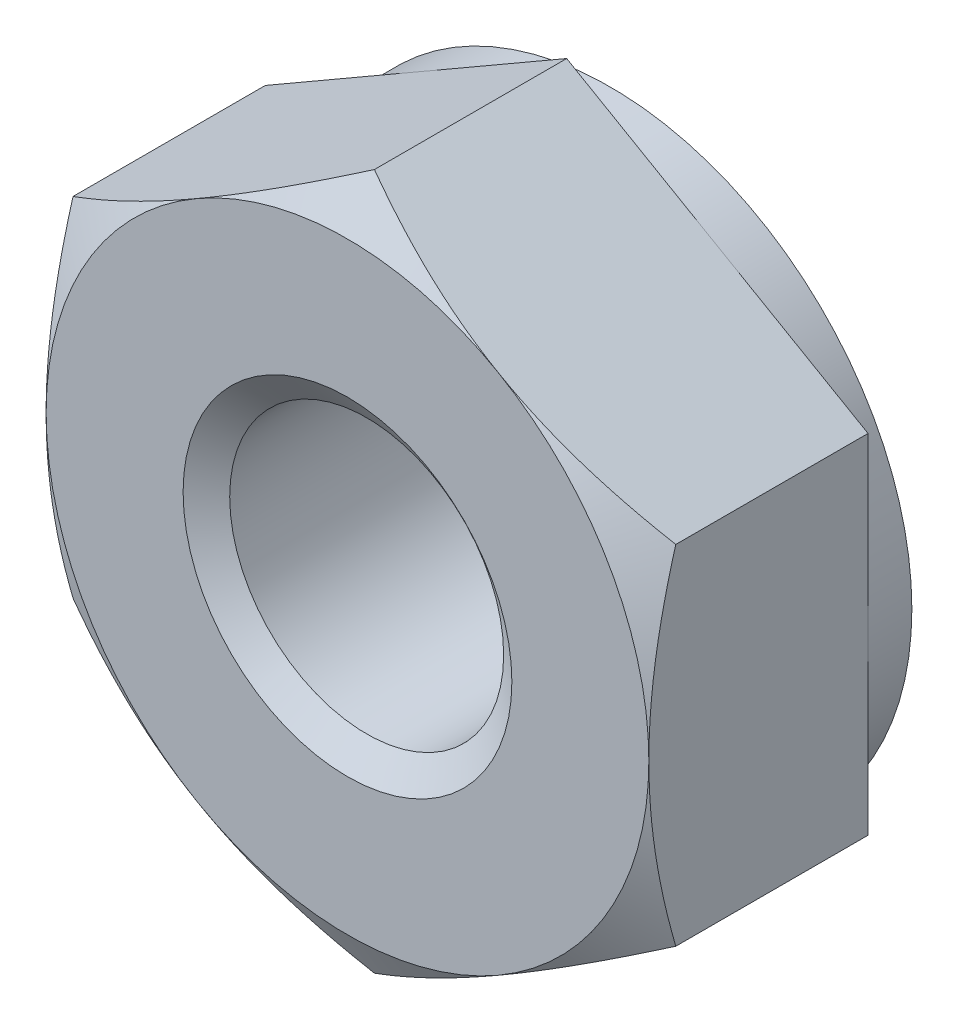
ISO-10303-21;
HEADER;
FILE_DESCRIPTION(('STEP AP214'),'2;1');
FILE_NAME('part.step','',(''),(''),'','','');
FILE_SCHEMA(('AUTOMOTIVE_DESIGN { 1 0 10303 214 1 1 1 1 }'));
ENDSEC;
DATA;
#1=APPLICATION_CONTEXT('core data for automotive mechanical design processes');
#2=APPLICATION_PROTOCOL_DEFINITION('international standard','automotive_design',2000,#1);
#3=PRODUCT_CONTEXT('',#1,'mechanical');
#4=PRODUCT('Part','Part','',(#3));
#5=PRODUCT_RELATED_PRODUCT_CATEGORY('part','',(#4));
#6=PRODUCT_DEFINITION_FORMATION('','',#4);
#7=PRODUCT_DEFINITION_CONTEXT('part definition',#1,'design');
#8=PRODUCT_DEFINITION('design','',#6,#7);
#9=PRODUCT_DEFINITION_SHAPE('','',#8);
#10=(LENGTH_UNIT() NAMED_UNIT(*) SI_UNIT(.MILLI.,.METRE.));
#11=(NAMED_UNIT(*) PLANE_ANGLE_UNIT() SI_UNIT($,.RADIAN.));
#12=(NAMED_UNIT(*) SI_UNIT($,.STERADIAN.) SOLID_ANGLE_UNIT());
#13=UNCERTAINTY_MEASURE_WITH_UNIT(LENGTH_MEASURE(1.E-05),#10,'distance_accuracy_value','');
#14=(GEOMETRIC_REPRESENTATION_CONTEXT(3) GLOBAL_UNCERTAINTY_ASSIGNED_CONTEXT((#13)) GLOBAL_UNIT_ASSIGNED_CONTEXT((#10,
#11,#12)) REPRESENTATION_CONTEXT('',''));
#15=CARTESIAN_POINT('',(0.,0.,0.));
#16=DIRECTION('',(0.,0.,1.));
#17=DIRECTION('',(1.,0.,0.));
#18=AXIS2_PLACEMENT_3D('',#15,#16,#17);
#19=CARTESIAN_POINT('',(0.,0.,0.));
#20=DIRECTION('',(0.,0.,-1.));
#21=DIRECTION('',(-1.,0.,0.));
#22=AXIS2_PLACEMENT_3D('',#19,#20,#21);
#23=CONICAL_SURFACE('',#22,2.75,1.0471975511966);
#24=CARTESIAN_POINT('',(0.,0.,0.));
#25=DIRECTION('',(0.,0.,1.));
#26=DIRECTION('',(-1.,0.,0.));
#27=AXIS2_PLACEMENT_3D('',#24,#25,#26);
#28=CIRCLE('',#27,2.75);
#29=CARTESIAN_POINT('',(-2.75,0.,0.));
#30=VERTEX_POINT('',#29);
#31=CARTESIAN_POINT('',(-1.37500000000002,-2.3815698604072,0.));
#32=VERTEX_POINT('',#31);
#33=EDGE_CURVE('E37',#30,#32,#28,.T.);
#34=ORIENTED_EDGE('',*,*,#33,.F.);
#35=CARTESIAN_POINT('',(-2.75,-1.58771324028035,-0.245620093064428));
#36=CARTESIAN_POINT('',(-2.75,-0.736860279189158,0.));
#37=CARTESIAN_POINT('',(-2.75,0.,0.));
#38=(BOUNDED_CURVE() B_SPLINE_CURVE(2,(#35,#36,#37),.UNSPECIFIED.,.F.,
.F.) B_SPLINE_CURVE_WITH_KNOTS((3,3),(0.494672246101127,0.803609596289679),
.UNSPECIFIED.) CURVE() GEOMETRIC_REPRESENTATION_ITEM() RATIONAL_B_SPLINE_CURVE((1.80512786004873,
1.94475498594665,1.94475498594665)) REPRESENTATION_ITEM(''));
#39=CARTESIAN_POINT('',(-2.75,-1.58771324027149,-0.24562009306187));
#40=VERTEX_POINT('',#39);
#41=EDGE_CURVE('E221',#40,#30,#38,.T.);
#42=ORIENTED_EDGE('',*,*,#41,.F.);
#43=CARTESIAN_POINT('',(-1.37500000000003,-2.38156986040722,0.));
#44=CARTESIAN_POINT('',(-2.01313972081752,-2.01313972081265,0.));
#45=CARTESIAN_POINT('',(-2.75000000000768,-1.58771324026706,-0.245620093064428));
#46=(BOUNDED_CURVE() B_SPLINE_CURVE(2,(#43,#44,#45),.UNSPECIFIED.,.F.,
.F.) B_SPLINE_CURVE_WITH_KNOTS((3,3),(0.803609596289677,1.11254694647822),
.UNSPECIFIED.) CURVE() GEOMETRIC_REPRESENTATION_ITEM() RATIONAL_B_SPLINE_CURVE((1.94475498594664,
1.94475498594664,1.80512786004873)) REPRESENTATION_ITEM(''));
#47=EDGE_CURVE('E338',#32,#40,#46,.T.);
#48=ORIENTED_EDGE('',*,*,#47,.F.);
#49=EDGE_LOOP('',(#34,#42,#48));
#50=FACE_BOUND('',#49,.T.);
#51=ADVANCED_FACE('F17',(#50),#23,.T.);
#52=CARTESIAN_POINT('',(0.,0.,0.));
#53=DIRECTION('',(0.,0.,-1.));
#54=DIRECTION('',(-1.,0.,0.));
#55=AXIS2_PLACEMENT_3D('',#52,#53,#54);
#56=CONICAL_SURFACE('',#55,2.75,1.0471975511966);
#57=CARTESIAN_POINT('',(0.,0.,0.));
#58=DIRECTION('',(0.,0.,1.));
#59=DIRECTION('',(-1.,0.,0.));
#60=AXIS2_PLACEMENT_3D('',#57,#58,#59);
#61=CIRCLE('',#60,2.75);
#62=CARTESIAN_POINT('',(1.375,-2.3815698604072,0.));
#63=VERTEX_POINT('',#62);
#64=EDGE_CURVE('E372',#32,#63,#61,.T.);
#65=ORIENTED_EDGE('',*,*,#64,.F.);
#66=CARTESIAN_POINT('',(7.60851754438167E-12,-3.17542648054738,-0.245620093064427));
#67=CARTESIAN_POINT('',(-0.736860279182547,-2.7500000000018,0.));
#68=CARTESIAN_POINT('',(-1.37500000000003,-2.38156986040722,0.));
#69=(BOUNDED_CURVE() B_SPLINE_CURVE(2,(#66,#67,#68),.UNSPECIFIED.,.F.,
.F.) B_SPLINE_CURVE_WITH_KNOTS((3,3),(0.494672246101137,0.803609596289677),
.UNSPECIFIED.) CURVE() GEOMETRIC_REPRESENTATION_ITEM() RATIONAL_B_SPLINE_CURVE((1.80512786004873,
1.94475498594664,1.94475498594664)) REPRESENTATION_ITEM(''));
#70=CARTESIAN_POINT('',(0.,-3.17542648054295,-0.24562009306187));
#71=VERTEX_POINT('',#70);
#72=EDGE_CURVE('E180',#71,#32,#69,.T.);
#73=ORIENTED_EDGE('',*,*,#72,.F.);
#74=CARTESIAN_POINT('',(1.37500000000002,-2.38156986040723,0.));
#75=CARTESIAN_POINT('',(0.736860279182506,-2.75000000000182,0.));
#76=CARTESIAN_POINT('',(-7.69732909524413E-12,-3.17542648054743,-0.245620093064455));
#77=(BOUNDED_CURVE() B_SPLINE_CURVE(2,(#74,#75,#76),.UNSPECIFIED.,.F.,
.F.) B_SPLINE_CURVE_WITH_KNOTS((3,3),(0.803609596289677,1.11254694647823),
.UNSPECIFIED.) CURVE() GEOMETRIC_REPRESENTATION_ITEM() RATIONAL_B_SPLINE_CURVE((1.94475498594664,
1.94475498594664,1.80512786004872)) REPRESENTATION_ITEM(''));
#78=EDGE_CURVE('E323',#63,#71,#77,.T.);
#79=ORIENTED_EDGE('',*,*,#78,.F.);
#80=EDGE_LOOP('',(#65,#73,#79));
#81=FACE_BOUND('',#80,.T.);
#82=ADVANCED_FACE('F421',(#81),#56,.T.);
#83=CARTESIAN_POINT('',(0.,0.,0.));
#84=DIRECTION('',(0.,0.,-1.));
#85=DIRECTION('',(-1.,0.,0.));
#86=AXIS2_PLACEMENT_3D('',#83,#84,#85);
#87=CONICAL_SURFACE('',#86,2.75,1.0471975511966);
#88=CARTESIAN_POINT('',(2.75,-1.58771324028037,-0.245620093064435));
#89=CARTESIAN_POINT('',(2.75,-0.736860279189165,0.));
#90=CARTESIAN_POINT('',(2.75,0.,0.));
#91=(BOUNDED_CURVE() B_SPLINE_CURVE(2,(#88,#89,#90),.UNSPECIFIED.,.F.,
.F.) B_SPLINE_CURVE_WITH_KNOTS((3,3),(0.494672246101124,0.803609596289678),
.UNSPECIFIED.) CURVE() GEOMETRIC_REPRESENTATION_ITEM() RATIONAL_B_SPLINE_CURVE((1.80512786004873,
1.94475498594665,1.94475498594665)) REPRESENTATION_ITEM(''));
#92=CARTESIAN_POINT('',(2.75,-1.58771324027152,-0.24562009306187));
#93=VERTEX_POINT('',#92);
#94=CARTESIAN_POINT('',(2.75,0.,0.));
#95=VERTEX_POINT('',#94);
#96=EDGE_CURVE('E320',#93,#95,#91,.T.);
#97=ORIENTED_EDGE('',*,*,#96,.T.);
#98=CARTESIAN_POINT('',(0.,0.,0.));
#99=DIRECTION('',(0.,0.,1.));
#100=DIRECTION('',(-1.,0.,0.));
#101=AXIS2_PLACEMENT_3D('',#98,#99,#100);
#102=CIRCLE('',#101,2.75);
#103=EDGE_CURVE('E237',#63,#95,#102,.T.);
#104=ORIENTED_EDGE('',*,*,#103,.F.);
#105=CARTESIAN_POINT('',(2.75000000000766,-1.58771324026709,-0.245620093064427));
#106=CARTESIAN_POINT('',(2.01313972081751,-2.01313972081267,0.));
#107=CARTESIAN_POINT('',(1.37500000000002,-2.38156986040723,0.));
#108=(BOUNDED_CURVE() B_SPLINE_CURVE(2,(#105,#106,#107),.UNSPECIFIED.,.F.,
.F.) B_SPLINE_CURVE_WITH_KNOTS((3,3),(0.494672246101139,0.803609596289677),
.UNSPECIFIED.) CURVE() GEOMETRIC_REPRESENTATION_ITEM() RATIONAL_B_SPLINE_CURVE((1.80512786004873,
1.94475498594664,1.94475498594664)) REPRESENTATION_ITEM(''));
#109=EDGE_CURVE('E288',#93,#63,#108,.T.);
#110=ORIENTED_EDGE('',*,*,#109,.F.);
#111=EDGE_LOOP('',(#97,#104,#110));
#112=FACE_BOUND('',#111,.T.);
#113=ADVANCED_FACE('F510',(#112),#87,.T.);
#114=CARTESIAN_POINT('',(0.,0.,0.));
#115=DIRECTION('',(0.,0.,-1.));
#116=DIRECTION('',(-1.,0.,0.));
#117=AXIS2_PLACEMENT_3D('',#114,#115,#116);
#118=CONICAL_SURFACE('',#117,2.75,1.0471975511966);
#119=CARTESIAN_POINT('',(0.,0.,0.));
#120=DIRECTION('',(0.,0.,1.));
#121=DIRECTION('',(1.,0.,0.));
#122=AXIS2_PLACEMENT_3D('',#119,#120,#121);
#123=CIRCLE('',#122,2.75);
#124=CARTESIAN_POINT('',(1.37500000000002,2.38156986040719,0.));
#125=VERTEX_POINT('',#124);
#126=EDGE_CURVE('E25',#95,#125,#123,.T.);
#127=ORIENTED_EDGE('',*,*,#126,.F.);
#128=CARTESIAN_POINT('',(2.75,0.,0.));
#129=CARTESIAN_POINT('',(2.75,0.736860279189152,0.));
#130=CARTESIAN_POINT('',(2.75,1.58771324028034,-0.245620093064426));
#131=(BOUNDED_CURVE() B_SPLINE_CURVE(2,(#128,#129,#130),.UNSPECIFIED.,.F.,
.F.) B_SPLINE_CURVE_WITH_KNOTS((3,3),(0.803609596289678,1.11254694647823),
.UNSPECIFIED.) CURVE() GEOMETRIC_REPRESENTATION_ITEM() RATIONAL_B_SPLINE_CURVE((1.94475498594665,
1.94475498594665,1.80512786004874)) REPRESENTATION_ITEM(''));
#132=CARTESIAN_POINT('',(2.75,1.58771324027149,-0.24562009306187));
#133=VERTEX_POINT('',#132);
#134=EDGE_CURVE('E283',#95,#133,#131,.T.);
#135=ORIENTED_EDGE('',*,*,#134,.T.);
#136=CARTESIAN_POINT('',(1.37500000000002,2.38156986040719,0.));
#137=CARTESIAN_POINT('',(2.0131397208175,2.01313972081262,0.));
#138=CARTESIAN_POINT('',(2.75000000000766,1.58771324026703,-0.245620093064411));
#139=(BOUNDED_CURVE() B_SPLINE_CURVE(2,(#136,#137,#138),.UNSPECIFIED.,.F.,
.F.) B_SPLINE_CURVE_WITH_KNOTS((3,3),(0.803609596289678,1.11254694647822),
.UNSPECIFIED.) CURVE() GEOMETRIC_REPRESENTATION_ITEM() RATIONAL_B_SPLINE_CURVE((1.94475498594666,
1.94475498594666,1.80512786004874)) REPRESENTATION_ITEM(''));
#140=EDGE_CURVE('E297',#125,#133,#139,.T.);
#141=ORIENTED_EDGE('',*,*,#140,.F.);
#142=EDGE_LOOP('',(#127,#135,#141));
#143=FACE_BOUND('',#142,.T.);
#144=ADVANCED_FACE('F512',(#143),#118,.T.);
#145=CARTESIAN_POINT('',(0.,0.,0.));
#146=DIRECTION('',(0.,0.,-1.));
#147=DIRECTION('',(-1.,0.,0.));
#148=AXIS2_PLACEMENT_3D('',#145,#146,#147);
#149=CONICAL_SURFACE('',#148,2.75,1.0471975511966);
#150=CARTESIAN_POINT('',(0.,0.,0.));
#151=DIRECTION('',(0.,0.,1.));
#152=DIRECTION('',(-1.,0.,0.));
#153=AXIS2_PLACEMENT_3D('',#150,#151,#152);
#154=CIRCLE('',#153,2.75);
#155=CARTESIAN_POINT('',(-1.375,2.3815698604072,0.));
#156=VERTEX_POINT('',#155);
#157=EDGE_CURVE('E11',#125,#156,#154,.T.);
#158=ORIENTED_EDGE('',*,*,#157,.F.);
#159=CARTESIAN_POINT('',(-7.66313295793138E-12,3.17542648054738,-0.245620093064428));
#160=CARTESIAN_POINT('',(0.73686027918252,2.75000000000178,0.));
#161=CARTESIAN_POINT('',(1.37500000000002,2.38156986040719,0.));
#162=(BOUNDED_CURVE() B_SPLINE_CURVE(2,(#159,#160,#161),.UNSPECIFIED.,.F.,
.F.) B_SPLINE_CURVE_WITH_KNOTS((3,3),(0.494672246101126,0.803609596289678),
.UNSPECIFIED.) CURVE() GEOMETRIC_REPRESENTATION_ITEM() RATIONAL_B_SPLINE_CURVE((1.80512786004874,
1.94475498594666,1.94475498594666)) REPRESENTATION_ITEM(''));
#163=CARTESIAN_POINT('',(0.,3.17542648054295,-0.24562009306187));
#164=VERTEX_POINT('',#163);
#165=EDGE_CURVE('E282',#164,#125,#162,.T.);
#166=ORIENTED_EDGE('',*,*,#165,.F.);
#167=CARTESIAN_POINT('',(-1.37500000000001,2.3815698604072,0.));
#168=CARTESIAN_POINT('',(-0.736860279182506,2.75000000000178,0.));
#169=CARTESIAN_POINT('',(7.67863192664144E-12,3.17542648054738,-0.245620093064426));
#170=(BOUNDED_CURVE() B_SPLINE_CURVE(2,(#167,#168,#169),.UNSPECIFIED.,.F.,
.F.) B_SPLINE_CURVE_WITH_KNOTS((3,3),(0.803609596289679,1.11254694647823),
.UNSPECIFIED.) CURVE() GEOMETRIC_REPRESENTATION_ITEM() RATIONAL_B_SPLINE_CURVE((1.94475498594665,
1.94475498594665,1.80512786004873)) REPRESENTATION_ITEM(''));
#171=EDGE_CURVE('E254',#156,#164,#170,.T.);
#172=ORIENTED_EDGE('',*,*,#171,.F.);
#173=EDGE_LOOP('',(#158,#166,#172));
#174=FACE_BOUND('',#173,.T.);
#175=ADVANCED_FACE('F520',(#174),#149,.T.);
#176=CARTESIAN_POINT('',(0.,0.,0.));
#177=DIRECTION('',(0.,0.,-1.));
#178=DIRECTION('',(-1.,0.,0.));
#179=AXIS2_PLACEMENT_3D('',#176,#177,#178);
#180=CONICAL_SURFACE('',#179,2.75,1.0471975511966);
#181=CARTESIAN_POINT('',(-2.75,0.,0.));
#182=CARTESIAN_POINT('',(-2.75,0.736860279189145,0.));
#183=CARTESIAN_POINT('',(-2.75,1.58771324028032,-0.245620093064419));
#184=(BOUNDED_CURVE() B_SPLINE_CURVE(2,(#181,#182,#183),.UNSPECIFIED.,.F.,
.F.) B_SPLINE_CURVE_WITH_KNOTS((3,3),(0.803609596289679,1.11254694647823),
.UNSPECIFIED.) CURVE() GEOMETRIC_REPRESENTATION_ITEM() RATIONAL_B_SPLINE_CURVE((1.94475498594665,
1.94475498594665,1.80512786004874)) REPRESENTATION_ITEM(''));
#185=CARTESIAN_POINT('',(-2.75,1.58771324027146,-0.245620093061869));
#186=VERTEX_POINT('',#185);
#187=EDGE_CURVE('E225',#30,#186,#184,.T.);
#188=ORIENTED_EDGE('',*,*,#187,.F.);
#189=CARTESIAN_POINT('',(0.,0.,0.));
#190=DIRECTION('',(0.,0.,1.));
#191=DIRECTION('',(-1.,0.,0.));
#192=AXIS2_PLACEMENT_3D('',#189,#190,#191);
#193=CIRCLE('',#192,2.75);
#194=EDGE_CURVE('E368',#156,#30,#193,.T.);
#195=ORIENTED_EDGE('',*,*,#194,.F.);
#196=CARTESIAN_POINT('',(-2.75000000000767,1.58771324026703,-0.245620093064418));
#197=CARTESIAN_POINT('',(-2.0131397208175,2.01313972081262,0.));
#198=CARTESIAN_POINT('',(-1.37500000000001,2.3815698604072,0.));
#199=(BOUNDED_CURVE() B_SPLINE_CURVE(2,(#196,#197,#198),.UNSPECIFIED.,.F.,
.F.) B_SPLINE_CURVE_WITH_KNOTS((3,3),(0.494672246101133,0.803609596289679),
.UNSPECIFIED.) CURVE() GEOMETRIC_REPRESENTATION_ITEM() RATIONAL_B_SPLINE_CURVE((1.80512786004874,
1.94475498594665,1.94475498594665)) REPRESENTATION_ITEM(''));
#200=EDGE_CURVE('E248',#186,#156,#199,.T.);
#201=ORIENTED_EDGE('',*,*,#200,.F.);
#202=EDGE_LOOP('',(#188,#195,#201));
#203=FACE_BOUND('',#202,.T.);
#204=ADVANCED_FACE('F427',(#203),#180,.T.);
#205=CARTESIAN_POINT('',(0.,13.175426480543,-2.));
#206=DIRECTION('',(0.,0.,-1.));
#207=DIRECTION('',(0.,-1.,0.));
#208=AXIS2_PLACEMENT_3D('',#205,#206,#207);
#209=PLANE('',#208);
#210=DIRECTION('',(0.,-1.,0.));
#211=VECTOR('',#210,1.);
#212=CARTESIAN_POINT('',(-2.75,1.58771324027146,-2.));
#213=LINE('',#212,#211);
#214=CARTESIAN_POINT('',(-2.75,0.,-2.));
#215=VERTEX_POINT('',#214);
#216=CARTESIAN_POINT('',(-2.75,-1.58771324027149,-2.));
#217=VERTEX_POINT('',#216);
#218=EDGE_CURVE('E47',#215,#217,#213,.T.);
#219=ORIENTED_EDGE('',*,*,#218,.F.);
#220=CARTESIAN_POINT('',(0.,0.,-2.));
#221=DIRECTION('',(0.,0.,1.));
#222=DIRECTION('',(1.,0.,0.));
#223=AXIS2_PLACEMENT_3D('',#220,#221,#222);
#224=CIRCLE('',#223,2.75);
#225=CARTESIAN_POINT('',(-1.37500000000002,-2.3815698604072,-2.));
#226=VERTEX_POINT('',#225);
#227=EDGE_CURVE('E201',#215,#226,#224,.T.);
#228=ORIENTED_EDGE('',*,*,#227,.T.);
#229=DIRECTION('',(0.866025403784435,-0.500000000000006,0.));
#230=VECTOR('',#229,1.);
#231=CARTESIAN_POINT('',(-2.75,-1.58771324027149,-2.));
#232=LINE('',#231,#230);
#233=EDGE_CURVE('E353',#217,#226,#232,.T.);
#234=ORIENTED_EDGE('',*,*,#233,.F.);
#235=EDGE_LOOP('',(#219,#228,#234));
#236=FACE_BOUND('',#235,.T.);
#237=ADVANCED_FACE('F414',(#236),#209,.T.);
#238=CARTESIAN_POINT('',(0.,13.175426480543,-2.));
#239=DIRECTION('',(0.,0.,-1.));
#240=DIRECTION('',(0.,-1.,0.));
#241=AXIS2_PLACEMENT_3D('',#238,#239,#240);
#242=PLANE('',#241);
#243=CARTESIAN_POINT('',(0.,0.,-2.));
#244=DIRECTION('',(0.,0.,1.));
#245=DIRECTION('',(1.,0.,0.));
#246=AXIS2_PLACEMENT_3D('',#243,#244,#245);
#247=CIRCLE('',#246,2.75);
#248=CARTESIAN_POINT('',(-1.375,2.3815698604072,-2.));
#249=VERTEX_POINT('',#248);
#250=EDGE_CURVE('E219',#249,#215,#247,.T.);
#251=ORIENTED_EDGE('',*,*,#250,.T.);
#252=DIRECTION('',(0.,-1.,0.));
#253=VECTOR('',#252,1.);
#254=CARTESIAN_POINT('',(-2.75,1.58771324027146,-2.));
#255=LINE('',#254,#253);
#256=CARTESIAN_POINT('',(-2.75,1.58771324027146,-2.));
#257=VERTEX_POINT('',#256);
#258=EDGE_CURVE('E362',#257,#215,#255,.T.);
#259=ORIENTED_EDGE('',*,*,#258,.F.);
#260=DIRECTION('',(-0.866025403784437,-0.5,0.));
#261=VECTOR('',#260,1.);
#262=CARTESIAN_POINT('',(0.,3.17542648054295,-2.));
#263=LINE('',#262,#261);
#264=EDGE_CURVE('E278',#249,#257,#263,.T.);
#265=ORIENTED_EDGE('',*,*,#264,.F.);
#266=EDGE_LOOP('',(#251,#259,#265));
#267=FACE_BOUND('',#266,.T.);
#268=ADVANCED_FACE('F408',(#267),#242,.T.);
#269=CARTESIAN_POINT('',(0.,13.175426480543,-2.));
#270=DIRECTION('',(0.,0.,-1.));
#271=DIRECTION('',(0.,-1.,0.));
#272=AXIS2_PLACEMENT_3D('',#269,#270,#271);
#273=PLANE('',#272);
#274=DIRECTION('',(0.866025403784435,-0.500000000000006,0.));
#275=VECTOR('',#274,1.);
#276=CARTESIAN_POINT('',(-2.75,-1.58771324027149,-2.));
#277=LINE('',#276,#275);
#278=CARTESIAN_POINT('',(0.,-3.17542648054299,-2.));
#279=VERTEX_POINT('',#278);
#280=EDGE_CURVE('E196',#226,#279,#277,.T.);
#281=ORIENTED_EDGE('',*,*,#280,.F.);
#282=CARTESIAN_POINT('',(0.,0.,-2.));
#283=DIRECTION('',(0.,0.,1.));
#284=DIRECTION('',(1.,0.,0.));
#285=AXIS2_PLACEMENT_3D('',#282,#283,#284);
#286=CIRCLE('',#285,2.75);
#287=CARTESIAN_POINT('',(1.375,-2.3815698604072,-2.));
#288=VERTEX_POINT('',#287);
#289=EDGE_CURVE('E194',#226,#288,#286,.T.);
#290=ORIENTED_EDGE('',*,*,#289,.T.);
#291=DIRECTION('',(0.866025403784438,0.5,0.));
#292=VECTOR('',#291,1.);
#293=CARTESIAN_POINT('',(0.,-3.17542648054299,-2.));
#294=LINE('',#293,#292);
#295=EDGE_CURVE('E181',#279,#288,#294,.T.);
#296=ORIENTED_EDGE('',*,*,#295,.F.);
#297=EDGE_LOOP('',(#281,#290,#296));
#298=FACE_BOUND('',#297,.T.);
#299=ADVANCED_FACE('F195',(#298),#273,.T.);
#300=CARTESIAN_POINT('',(0.,13.175426480543,-2.));
#301=DIRECTION('',(0.,0.,-1.));
#302=DIRECTION('',(0.,-1.,0.));
#303=AXIS2_PLACEMENT_3D('',#300,#301,#302);
#304=PLANE('',#303);
#305=CARTESIAN_POINT('',(0.,0.,-2.));
#306=DIRECTION('',(0.,0.,1.));
#307=DIRECTION('',(1.,0.,0.));
#308=AXIS2_PLACEMENT_3D('',#305,#306,#307);
#309=CIRCLE('',#308,2.75);
#310=CARTESIAN_POINT('',(1.37500000000002,2.38156986040719,-2.));
#311=VERTEX_POINT('',#310);
#312=EDGE_CURVE('E244',#311,#249,#309,.T.);
#313=ORIENTED_EDGE('',*,*,#312,.T.);
#314=DIRECTION('',(-0.866025403784437,-0.5,0.));
#315=VECTOR('',#314,1.);
#316=CARTESIAN_POINT('',(0.,3.17542648054295,-2.));
#317=LINE('',#316,#315);
#318=CARTESIAN_POINT('',(0.,3.17542648054295,-2.));
#319=VERTEX_POINT('',#318);
#320=EDGE_CURVE('E274',#319,#249,#317,.T.);
#321=ORIENTED_EDGE('',*,*,#320,.F.);
#322=DIRECTION('',(-0.866025403784433,0.500000000000009,0.));
#323=VECTOR('',#322,1.);
#324=CARTESIAN_POINT('',(2.75,1.58771324027145,-2.));
#325=LINE('',#324,#323);
#326=EDGE_CURVE('E317',#311,#319,#325,.T.);
#327=ORIENTED_EDGE('',*,*,#326,.F.);
#328=EDGE_LOOP('',(#313,#321,#327));
#329=FACE_BOUND('',#328,.T.);
#330=ADVANCED_FACE('F445',(#329),#304,.T.);
#331=CARTESIAN_POINT('',(0.,13.175426480543,-2.));
#332=DIRECTION('',(0.,0.,-1.));
#333=DIRECTION('',(0.,-1.,0.));
#334=AXIS2_PLACEMENT_3D('',#331,#332,#333);
#335=PLANE('',#334);
#336=DIRECTION('',(0.,-1.,0.));
#337=VECTOR('',#336,1.);
#338=CARTESIAN_POINT('',(2.75,1.58771324027145,-2.));
#339=LINE('',#338,#337);
#340=CARTESIAN_POINT('',(2.75,0.,-2.));
#341=VERTEX_POINT('',#340);
#342=CARTESIAN_POINT('',(2.75,-1.5877132402715,-2.));
#343=VERTEX_POINT('',#342);
#344=EDGE_CURVE('E175',#341,#343,#339,.T.);
#345=ORIENTED_EDGE('',*,*,#344,.T.);
#346=DIRECTION('',(0.866025403784438,0.5,0.));
#347=VECTOR('',#346,1.);
#348=CARTESIAN_POINT('',(0.,-3.17542648054299,-2.));
#349=LINE('',#348,#347);
#350=EDGE_CURVE('E169',#288,#343,#349,.T.);
#351=ORIENTED_EDGE('',*,*,#350,.F.);
#352=CARTESIAN_POINT('',(0.,0.,-2.));
#353=DIRECTION('',(0.,0.,1.));
#354=DIRECTION('',(1.,0.,0.));
#355=AXIS2_PLACEMENT_3D('',#352,#353,#354);
#356=CIRCLE('',#355,2.75);
#357=EDGE_CURVE('E173',#288,#341,#356,.T.);
#358=ORIENTED_EDGE('',*,*,#357,.T.);
#359=EDGE_LOOP('',(#345,#351,#358));
#360=FACE_BOUND('',#359,.T.);
#361=ADVANCED_FACE('F171',(#360),#335,.T.);
#362=CARTESIAN_POINT('',(0.,13.175426480543,-2.));
#363=DIRECTION('',(0.,0.,-1.));
#364=DIRECTION('',(0.,-1.,0.));
#365=AXIS2_PLACEMENT_3D('',#362,#363,#364);
#366=PLANE('',#365);
#367=DIRECTION('',(0.,-1.,0.));
#368=VECTOR('',#367,1.);
#369=CARTESIAN_POINT('',(2.75,1.58771324027145,-2.));
#370=LINE('',#369,#368);
#371=CARTESIAN_POINT('',(2.75,1.58771324027145,-2.));
#372=VERTEX_POINT('',#371);
#373=EDGE_CURVE('E260',#372,#341,#370,.T.);
#374=ORIENTED_EDGE('',*,*,#373,.T.);
#375=CARTESIAN_POINT('',(0.,0.,-2.));
#376=DIRECTION('',(0.,0.,1.));
#377=DIRECTION('',(1.,0.,0.));
#378=AXIS2_PLACEMENT_3D('',#375,#376,#377);
#379=CIRCLE('',#378,2.75);
#380=EDGE_CURVE('E207',#341,#311,#379,.T.);
#381=ORIENTED_EDGE('',*,*,#380,.T.);
#382=DIRECTION('',(-0.866025403784433,0.500000000000009,0.));
#383=VECTOR('',#382,1.);
#384=CARTESIAN_POINT('',(2.75,1.58771324027145,-2.));
#385=LINE('',#384,#383);
#386=EDGE_CURVE('E313',#372,#311,#385,.T.);
#387=ORIENTED_EDGE('',*,*,#386,.F.);
#388=EDGE_LOOP('',(#374,#381,#387));
#389=FACE_BOUND('',#388,.T.);
#390=ADVANCED_FACE('F452',(#389),#366,.T.);
#391=CARTESIAN_POINT('',(0.,3.17542648054295,-2.4));
#392=DIRECTION('',(0.,0.,-1.));
#393=DIRECTION('',(0.,-1.,0.));
#394=AXIS2_PLACEMENT_3D('',#391,#392,#393);
#395=PLANE('',#394);
#396=CARTESIAN_POINT('',(0.,0.,-2.4));
#397=DIRECTION('',(0.,0.,1.));
#398=DIRECTION('',(-1.,0.,0.));
#399=AXIS2_PLACEMENT_3D('',#396,#397,#398);
#400=CIRCLE('',#399,1.5);
#401=CARTESIAN_POINT('',(-1.5,0.,-2.4));
#402=VERTEX_POINT('',#401);
#403=EDGE_CURVE('E495',#402,#402,#400,.T.);
#404=ORIENTED_EDGE('',*,*,#403,.T.);
#405=EDGE_LOOP('',(#404));
#406=FACE_BOUND('',#405,.T.);
#407=CARTESIAN_POINT('',(0.,0.,-2.4));
#408=DIRECTION('',(0.,0.,1.));
#409=DIRECTION('',(-1.,0.,0.));
#410=AXIS2_PLACEMENT_3D('',#407,#408,#409);
#411=CIRCLE('',#410,2.75);
#412=CARTESIAN_POINT('',(-2.75,0.,-2.4));
#413=VERTEX_POINT('',#412);
#414=EDGE_CURVE('E238',#413,#413,#411,.T.);
#415=ORIENTED_EDGE('',*,*,#414,.F.);
#416=EDGE_LOOP('',(#415));
#417=FACE_BOUND('',#416,.T.);
#418=ADVANCED_FACE('F622',(#406,#417),#395,.T.);
#419=CARTESIAN_POINT('',(0.,3.17542648054295,0.));
#420=DIRECTION('',(0.,0.,-1.));
#421=DIRECTION('',(0.,-1.,0.));
#422=AXIS2_PLACEMENT_3D('',#419,#420,#421);
#423=PLANE('',#422);
#424=CARTESIAN_POINT('',(0.,0.,0.));
#425=DIRECTION('',(0.,0.,1.));
#426=DIRECTION('',(1.,0.,0.));
#427=AXIS2_PLACEMENT_3D('',#424,#425,#426);
#428=CIRCLE('',#427,1.5);
#429=CARTESIAN_POINT('',(-1.5,0.,0.));
#430=VERTEX_POINT('',#429);
#431=EDGE_CURVE('E209',#430,#430,#428,.T.);
#432=ORIENTED_EDGE('',*,*,#431,.F.);
#433=EDGE_LOOP('',(#432));
#434=FACE_BOUND('',#433,.T.);
#435=ORIENTED_EDGE('',*,*,#194,.T.);
#436=ORIENTED_EDGE('',*,*,#33,.T.);
#437=ORIENTED_EDGE('',*,*,#64,.T.);
#438=ORIENTED_EDGE('',*,*,#103,.T.);
#439=ORIENTED_EDGE('',*,*,#126,.T.);
#440=ORIENTED_EDGE('',*,*,#157,.T.);
#441=EDGE_LOOP('',(#435,#436,#437,#438,#439,#440));
#442=FACE_BOUND('',#441,.T.);
#443=ADVANCED_FACE('F423',(#434,#442),#423,.F.);
#444=CARTESIAN_POINT('',(-2.75,1.58771324027146,-2.4));
#445=DIRECTION('',(-1.,0.,0.));
#446=DIRECTION('',(0.,0.,1.));
#447=AXIS2_PLACEMENT_3D('',#444,#445,#446);
#448=PLANE('',#447);
#449=DIRECTION('',(0.,0.,1.));
#450=VECTOR('',#449,1.);
#451=CARTESIAN_POINT('',(-2.75,-1.58771324027149,-2.4));
#452=LINE('',#451,#450);
#453=EDGE_CURVE('E347',#217,#40,#452,.T.);
#454=ORIENTED_EDGE('',*,*,#453,.T.);
#455=ORIENTED_EDGE('',*,*,#41,.T.);
#456=ORIENTED_EDGE('',*,*,#187,.T.);
#457=DIRECTION('',(0.,0.,1.));
#458=VECTOR('',#457,1.);
#459=CARTESIAN_POINT('',(-2.75,1.58771324027146,-2.4));
#460=LINE('',#459,#458);
#461=EDGE_CURVE('E247',#257,#186,#460,.T.);
#462=ORIENTED_EDGE('',*,*,#461,.F.);
#463=ORIENTED_EDGE('',*,*,#258,.T.);
#464=ORIENTED_EDGE('',*,*,#218,.T.);
#465=EDGE_LOOP('',(#454,#455,#456,#462,#463,#464));
#466=FACE_BOUND('',#465,.T.);
#467=ADVANCED_FACE('F403',(#466),#448,.T.);
#468=CARTESIAN_POINT('',(-2.75,-1.58771324027149,-2.4));
#469=DIRECTION('',(-0.500000000000006,-0.866025403784435,0.));
#470=DIRECTION('',(-0.866025403784435,0.500000000000006,0.));
#471=AXIS2_PLACEMENT_3D('',#468,#469,#470);
#472=PLANE('',#471);
#473=DIRECTION('',(0.,0.,1.));
#474=VECTOR('',#473,1.);
#475=CARTESIAN_POINT('',(0.,-3.17542648054299,-2.4));
#476=LINE('',#475,#474);
#477=EDGE_CURVE('E189',#279,#71,#476,.T.);
#478=ORIENTED_EDGE('',*,*,#477,.T.);
#479=ORIENTED_EDGE('',*,*,#72,.T.);
#480=ORIENTED_EDGE('',*,*,#47,.T.);
#481=ORIENTED_EDGE('',*,*,#453,.F.);
#482=ORIENTED_EDGE('',*,*,#233,.T.);
#483=ORIENTED_EDGE('',*,*,#280,.T.);
#484=EDGE_LOOP('',(#478,#479,#480,#481,#482,#483));
#485=FACE_BOUND('',#484,.T.);
#486=ADVANCED_FACE('F417',(#485),#472,.T.);
#487=CARTESIAN_POINT('',(0.,-3.17542648054299,-2.4));
#488=DIRECTION('',(0.5,-0.866025403784438,0.));
#489=DIRECTION('',(0.,0.,-1.));
#490=AXIS2_PLACEMENT_3D('',#487,#488,#489);
#491=PLANE('',#490);
#492=DIRECTION('',(0.,0.,1.));
#493=VECTOR('',#492,1.);
#494=CARTESIAN_POINT('',(2.75,-1.58771324027151,-2.4));
#495=LINE('',#494,#493);
#496=EDGE_CURVE('E261',#343,#93,#495,.T.);
#497=ORIENTED_EDGE('',*,*,#496,.T.);
#498=ORIENTED_EDGE('',*,*,#109,.T.);
#499=ORIENTED_EDGE('',*,*,#78,.T.);
#500=ORIENTED_EDGE('',*,*,#477,.F.);
#501=ORIENTED_EDGE('',*,*,#295,.T.);
#502=ORIENTED_EDGE('',*,*,#350,.T.);
#503=EDGE_LOOP('',(#497,#498,#499,#500,#501,#502));
#504=FACE_BOUND('',#503,.T.);
#505=ADVANCED_FACE('F186',(#504),#491,.T.);
#506=CARTESIAN_POINT('',(2.75,1.58771324027145,-2.4));
#507=DIRECTION('',(-1.,0.,0.));
#508=DIRECTION('',(0.,0.,1.));
#509=AXIS2_PLACEMENT_3D('',#506,#507,#508);
#510=PLANE('',#509);
#511=ORIENTED_EDGE('',*,*,#96,.F.);
#512=ORIENTED_EDGE('',*,*,#496,.F.);
#513=ORIENTED_EDGE('',*,*,#344,.F.);
#514=ORIENTED_EDGE('',*,*,#373,.F.);
#515=DIRECTION('',(0.,0.,1.));
#516=VECTOR('',#515,1.);
#517=CARTESIAN_POINT('',(2.75,1.58771324027145,-2.4));
#518=LINE('',#517,#516);
#519=EDGE_CURVE('E306',#372,#133,#518,.T.);
#520=ORIENTED_EDGE('',*,*,#519,.T.);
#521=ORIENTED_EDGE('',*,*,#134,.F.);
#522=EDGE_LOOP('',(#511,#512,#513,#514,#520,#521));
#523=FACE_BOUND('',#522,.T.);
#524=ADVANCED_FACE('F455',(#523),#510,.F.);
#525=CARTESIAN_POINT('',(2.75,1.58771324027145,-2.4));
#526=DIRECTION('',(0.500000000000009,0.866025403784433,0.));
#527=DIRECTION('',(0.,0.,-1.));
#528=AXIS2_PLACEMENT_3D('',#525,#526,#527);
#529=PLANE('',#528);
#530=DIRECTION('',(0.,0.,1.));
#531=VECTOR('',#530,1.);
#532=CARTESIAN_POINT('',(0.,3.17542648054295,-2.4));
#533=LINE('',#532,#531);
#534=EDGE_CURVE('E267',#319,#164,#533,.T.);
#535=ORIENTED_EDGE('',*,*,#534,.T.);
#536=ORIENTED_EDGE('',*,*,#165,.T.);
#537=ORIENTED_EDGE('',*,*,#140,.T.);
#538=ORIENTED_EDGE('',*,*,#519,.F.);
#539=ORIENTED_EDGE('',*,*,#386,.T.);
#540=ORIENTED_EDGE('',*,*,#326,.T.);
#541=EDGE_LOOP('',(#535,#536,#537,#538,#539,#540));
#542=FACE_BOUND('',#541,.T.);
#543=ADVANCED_FACE('F450',(#542),#529,.T.);
#544=CARTESIAN_POINT('',(0.,3.17542648054295,-2.4));
#545=DIRECTION('',(-0.5,0.866025403784436,0.));
#546=DIRECTION('',(0.,0.,1.));
#547=AXIS2_PLACEMENT_3D('',#544,#545,#546);
#548=PLANE('',#547);
#549=ORIENTED_EDGE('',*,*,#461,.T.);
#550=ORIENTED_EDGE('',*,*,#200,.T.);
#551=ORIENTED_EDGE('',*,*,#171,.T.);
#552=ORIENTED_EDGE('',*,*,#534,.F.);
#553=ORIENTED_EDGE('',*,*,#320,.T.);
#554=ORIENTED_EDGE('',*,*,#264,.T.);
#555=EDGE_LOOP('',(#549,#550,#551,#552,#553,#554));
#556=FACE_BOUND('',#555,.T.);
#557=ADVANCED_FACE('F429',(#556),#548,.T.);
#558=CARTESIAN_POINT('',(0.,0.,-2.4));
#559=DIRECTION('',(0.,0.,1.));
#560=DIRECTION('',(1.,0.,0.));
#561=AXIS2_PLACEMENT_3D('',#558,#559,#560);
#562=CYLINDRICAL_SURFACE('',#561,1.25);
#563=CARTESIAN_POINT('',(0.,0.,-2.19954811544757));
#564=DIRECTION('',(0.,0.,1.));
#565=DIRECTION('',(-1.,0.,0.));
#566=AXIS2_PLACEMENT_3D('',#563,#564,#565);
#567=CIRCLE('',#566,1.25);
#568=CARTESIAN_POINT('',(-1.25,0.,-2.19954811544757));
#569=VERTEX_POINT('',#568);
#570=CARTESIAN_POINT('',(1.25,0.,-2.19954811544757));
#571=VERTEX_POINT('',#570);
#572=EDGE_CURVE('E437',#569,#571,#567,.T.);
#573=ORIENTED_EDGE('',*,*,#572,.F.);
#574=DIRECTION('',(0.,0.,1.));
#575=VECTOR('',#574,1.);
#576=CARTESIAN_POINT('',(-1.25,0.,-2.4));
#577=LINE('',#576,#575);
#578=CARTESIAN_POINT('',(-1.25,0.,-0.175051884552427));
#579=VERTEX_POINT('',#578);
#580=EDGE_CURVE('E243',#569,#579,#577,.T.);
#581=ORIENTED_EDGE('',*,*,#580,.T.);
#582=CARTESIAN_POINT('',(0.,0.,-0.175051884552427));
#583=DIRECTION('',(0.,0.,-1.));
#584=DIRECTION('',(1.,0.,0.));
#585=AXIS2_PLACEMENT_3D('',#582,#583,#584);
#586=CIRCLE('',#585,1.25);
#587=EDGE_CURVE('E393',#579,#579,#586,.T.);
#588=ORIENTED_EDGE('',*,*,#587,.F.);
#589=ORIENTED_EDGE('',*,*,#580,.F.);
#590=CARTESIAN_POINT('',(0.,0.,-2.19954811544757));
#591=DIRECTION('',(0.,0.,1.));
#592=DIRECTION('',(-1.,0.,0.));
#593=AXIS2_PLACEMENT_3D('',#590,#591,#592);
#594=CIRCLE('',#593,1.25);
#595=EDGE_CURVE('E387',#571,#569,#594,.T.);
#596=ORIENTED_EDGE('',*,*,#595,.F.);
#597=EDGE_LOOP('',(#573,#581,#588,#589,#596));
#598=FACE_BOUND('',#597,.T.);
#599=ADVANCED_FACE('F475',(#598),#562,.F.);
#600=CARTESIAN_POINT('',(0.,0.,0.));
#601=DIRECTION('',(0.,0.,1.));
#602=DIRECTION('',(1.,0.,0.));
#603=AXIS2_PLACEMENT_3D('',#600,#601,#602);
#604=CYLINDRICAL_SURFACE('',#603,2.75);
#605=ORIENTED_EDGE('',*,*,#357,.F.);
#606=ORIENTED_EDGE('',*,*,#289,.F.);
#607=ORIENTED_EDGE('',*,*,#227,.F.);
#608=DIRECTION('',(0.,0.,-1.));
#609=VECTOR('',#608,1.);
#610=CARTESIAN_POINT('',(-2.75,0.,0.));
#611=LINE('',#610,#609);
#612=EDGE_CURVE('E233',#215,#413,#611,.T.);
#613=ORIENTED_EDGE('',*,*,#612,.T.);
#614=ORIENTED_EDGE('',*,*,#414,.T.);
#615=ORIENTED_EDGE('',*,*,#612,.F.);
#616=ORIENTED_EDGE('',*,*,#250,.F.);
#617=ORIENTED_EDGE('',*,*,#312,.F.);
#618=ORIENTED_EDGE('',*,*,#380,.F.);
#619=EDGE_LOOP('',(#605,#606,#607,#613,#614,#615,#616,#617,#618));
#620=FACE_BOUND('',#619,.T.);
#621=ADVANCED_FACE('F204',(#620),#604,.T.);
#622=CARTESIAN_POINT('',(0.,0.,-0.192557073007669));
#623=DIRECTION('',(0.,0.,1.));
#624=DIRECTION('',(1.,0.,0.));
#625=AXIS2_PLACEMENT_3D('',#622,#623,#624);
#626=CONICAL_SURFACE('',#625,1.225,0.959931088596875);
#627=ORIENTED_EDGE('',*,*,#587,.T.);
#628=DIRECTION('',(-0.819152044288988,0.,0.573576436351051));
#629=VECTOR('',#628,1.);
#630=CARTESIAN_POINT('',(-1.225,0.,-0.192557073007669));
#631=LINE('',#630,#629);
#632=EDGE_CURVE('E215',#579,#430,#631,.T.);
#633=ORIENTED_EDGE('',*,*,#632,.T.);
#634=ORIENTED_EDGE('',*,*,#431,.T.);
#635=ORIENTED_EDGE('',*,*,#632,.F.);
#636=EDGE_LOOP('',(#627,#633,#634,#635));
#637=FACE_BOUND('',#636,.T.);
#638=ADVANCED_FACE('F470',(#637),#626,.F.);
#639=CARTESIAN_POINT('',(0.,0.,-2.3746));
#640=DIRECTION('',(0.,0.,-1.));
#641=DIRECTION('',(-1.,0.,0.));
#642=AXIS2_PLACEMENT_3D('',#639,#640,#641);
#643=CONICAL_SURFACE('',#642,1.5,0.959931088596883);
#644=ORIENTED_EDGE('',*,*,#572,.T.);
#645=DIRECTION('',(0.819152044288993,0.,-0.573576436351044));
#646=VECTOR('',#645,1.);
#647=CARTESIAN_POINT('',(1.5,0.,-2.3746));
#648=LINE('',#647,#646);
#649=CARTESIAN_POINT('',(1.5,0.,-2.3746));
#650=VERTEX_POINT('',#649);
#651=EDGE_CURVE('E439',#571,#650,#648,.T.);
#652=ORIENTED_EDGE('',*,*,#651,.T.);
#653=CARTESIAN_POINT('',(0.,0.,-2.3746));
#654=DIRECTION('',(0.,0.,1.));
#655=DIRECTION('',(1.,0.,0.));
#656=AXIS2_PLACEMENT_3D('',#653,#654,#655);
#657=CIRCLE('',#656,1.5);
#658=CARTESIAN_POINT('',(-1.5,0.,-2.3746));
#659=VERTEX_POINT('',#658);
#660=EDGE_CURVE('E463',#659,#650,#657,.T.);
#661=ORIENTED_EDGE('',*,*,#660,.F.);
#662=CARTESIAN_POINT('',(0.,0.,-2.3746));
#663=DIRECTION('',(0.,0.,1.));
#664=DIRECTION('',(1.,0.,0.));
#665=AXIS2_PLACEMENT_3D('',#662,#663,#664);
#666=CIRCLE('',#665,1.5);
#667=EDGE_CURVE('E464',#650,#659,#666,.T.);
#668=ORIENTED_EDGE('',*,*,#667,.F.);
#669=ORIENTED_EDGE('',*,*,#651,.F.);
#670=ORIENTED_EDGE('',*,*,#595,.T.);
#671=EDGE_LOOP('',(#644,#652,#661,#668,#669,#670));
#672=FACE_BOUND('',#671,.T.);
#673=ADVANCED_FACE('F483',(#672),#643,.F.);
#674=CARTESIAN_POINT('',(0.,0.,-25.0375057290932));
#675=DIRECTION('',(0.,0.,1.));
#676=DIRECTION('',(1.,0.,0.));
#677=AXIS2_PLACEMENT_3D('',#674,#675,#676);
#678=CYLINDRICAL_SURFACE('',#677,1.5);
#679=ORIENTED_EDGE('',*,*,#403,.F.);
#680=DIRECTION('',(0.,0.,1.));
#681=VECTOR('',#680,1.);
#682=CARTESIAN_POINT('',(-1.5,0.,-25.0375057290932));
#683=LINE('',#682,#681);
#684=EDGE_CURVE('E492',#402,#659,#683,.T.);
#685=ORIENTED_EDGE('',*,*,#684,.T.);
#686=ORIENTED_EDGE('',*,*,#660,.T.);
#687=ORIENTED_EDGE('',*,*,#667,.T.);
#688=ORIENTED_EDGE('',*,*,#684,.F.);
#689=EDGE_LOOP('',(#679,#685,#686,#687,#688));
#690=FACE_BOUND('',#689,.T.);
#691=ADVANCED_FACE('F491',(#690),#678,.F.);
#692=CLOSED_SHELL('',(#51,#82,#113,#144,#175,#204,#237,#268,#299,#330,#361,#390,#418,#443,#467,
#486,#505,#524,#543,#557,#599,#621,#638,#673,#691));
#693=MANIFOLD_SOLID_BREP('B1',#692);
#694=ADVANCED_BREP_SHAPE_REPRESENTATION('',(#18,#693),#14);
#695=SHAPE_DEFINITION_REPRESENTATION(#9,#694);
ENDSEC;
END-ISO-10303-21;
